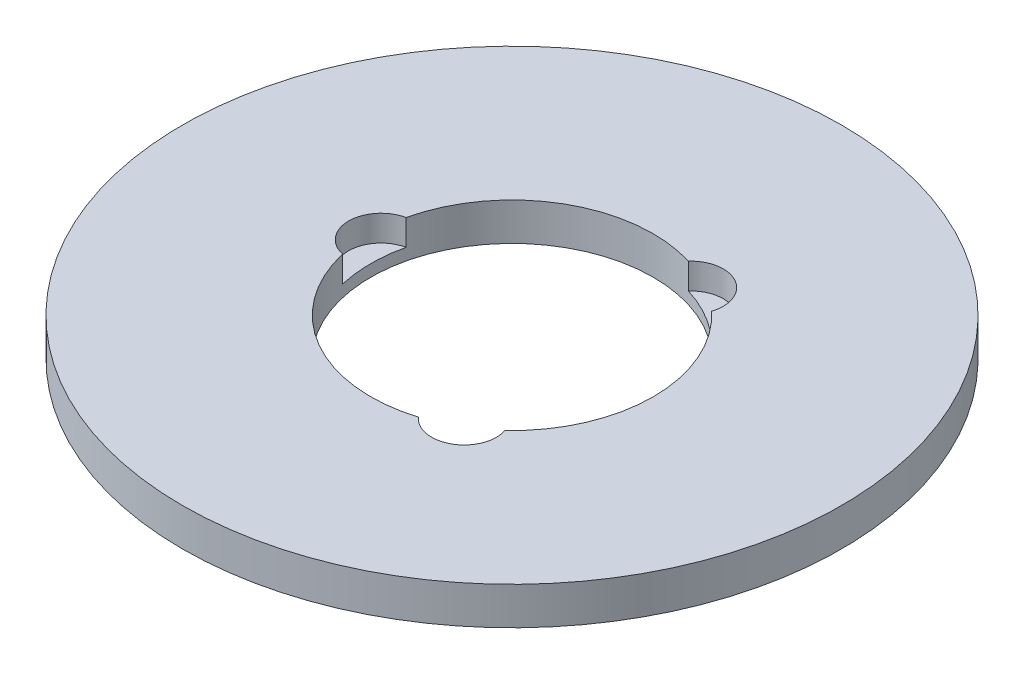
ISO-10303-21;
HEADER;
FILE_DESCRIPTION(('STEP AP214'),'2;1');
FILE_NAME('part.step','',(''),(''),'','','');
FILE_SCHEMA(('AUTOMOTIVE_DESIGN { 1 0 10303 214 1 1 1 1 }'));
ENDSEC;
DATA;
#1=APPLICATION_CONTEXT('core data for automotive mechanical design processes');
#2=APPLICATION_PROTOCOL_DEFINITION('international standard','automotive_design',2000,#1);
#3=PRODUCT_CONTEXT('',#1,'mechanical');
#4=PRODUCT('Part','Part','',(#3));
#5=PRODUCT_RELATED_PRODUCT_CATEGORY('part','',(#4));
#6=PRODUCT_DEFINITION_FORMATION('','',#4);
#7=PRODUCT_DEFINITION_CONTEXT('part definition',#1,'design');
#8=PRODUCT_DEFINITION('design','',#6,#7);
#9=PRODUCT_DEFINITION_SHAPE('','',#8);
#10=(LENGTH_UNIT() NAMED_UNIT(*) SI_UNIT(.MILLI.,.METRE.));
#11=(NAMED_UNIT(*) PLANE_ANGLE_UNIT() SI_UNIT($,.RADIAN.));
#12=(NAMED_UNIT(*) SI_UNIT($,.STERADIAN.) SOLID_ANGLE_UNIT());
#13=UNCERTAINTY_MEASURE_WITH_UNIT(LENGTH_MEASURE(1.E-05),#10,'distance_accuracy_value','');
#14=(GEOMETRIC_REPRESENTATION_CONTEXT(3) GLOBAL_UNCERTAINTY_ASSIGNED_CONTEXT((#13)) GLOBAL_UNIT_ASSIGNED_CONTEXT((#10,
#11,#12)) REPRESENTATION_CONTEXT('',''));
#15=CARTESIAN_POINT('',(0.,0.,0.));
#16=DIRECTION('',(0.,0.,1.));
#17=DIRECTION('',(1.,0.,0.));
#18=AXIS2_PLACEMENT_3D('',#15,#16,#17);
#19=CARTESIAN_POINT('',(0.,8.,0.));
#20=DIRECTION('',(0.,-1.,0.));
#21=DIRECTION('',(0.,0.,-1.));
#22=AXIS2_PLACEMENT_3D('',#19,#20,#21);
#23=CYLINDRICAL_SURFACE('',#22,70.);
#24=CARTESIAN_POINT('',(0.,8.,0.));
#25=DIRECTION('',(0.,1.,0.));
#26=DIRECTION('',(0.,0.,1.));
#27=AXIS2_PLACEMENT_3D('',#24,#25,#26);
#28=CIRCLE('',#27,70.);
#29=CARTESIAN_POINT('',(0.,8.,70.));
#30=VERTEX_POINT('',#29);
#31=EDGE_CURVE('E130',#30,#30,#28,.T.);
#32=ORIENTED_EDGE('',*,*,#31,.F.);
#33=EDGE_LOOP('',(#32));
#34=FACE_BOUND('',#33,.T.);
#35=CARTESIAN_POINT('',(0.,0.,0.));
#36=DIRECTION('',(0.,1.,0.));
#37=DIRECTION('',(0.,0.,1.));
#38=AXIS2_PLACEMENT_3D('',#35,#36,#37);
#39=CIRCLE('',#38,70.);
#40=CARTESIAN_POINT('',(0.,0.,70.));
#41=VERTEX_POINT('',#40);
#42=EDGE_CURVE('E117',#41,#41,#39,.T.);
#43=ORIENTED_EDGE('',*,*,#42,.T.);
#44=EDGE_LOOP('',(#43));
#45=FACE_BOUND('',#44,.T.);
#46=ADVANCED_FACE('F39',(#34,#45),#23,.T.);
#47=CARTESIAN_POINT('',(0.,8.,0.));
#48=DIRECTION('',(0.,1.,0.));
#49=DIRECTION('',(0.,0.,1.));
#50=AXIS2_PLACEMENT_3D('',#47,#48,#49);
#51=PLANE('',#50);
#52=CARTESIAN_POINT('',(13.9045154631195,8.,24.0833272367497));
#53=DIRECTION('',(0.,1.,0.));
#54=DIRECTION('',(0.866025403784436,0.,-0.500000000000004));
#55=AXIS2_PLACEMENT_3D('',#52,#53,#54);
#56=CIRCLE('',#55,6.88852052470689);
#57=CARTESIAN_POINT('',(8.77981268232638,8.,28.6864931503183));
#58=VERTEX_POINT('',#57);
#59=CARTESIAN_POINT('',(20.453325472501,8.,21.9467873985224));
#60=VERTEX_POINT('',#59);
#61=EDGE_CURVE('E148',#58,#60,#56,.T.);
#62=ORIENTED_EDGE('',*,*,#61,.F.);
#63=CARTESIAN_POINT('',(0.,8.,0.));
#64=DIRECTION('',(0.,1.,0.));
#65=DIRECTION('',(0.,0.,1.));
#66=AXIS2_PLACEMENT_3D('',#63,#64,#65);
#67=CIRCLE('',#66,30.);
#68=CARTESIAN_POINT('',(-29.2331381548271,8.,6.73970575179587));
#69=VERTEX_POINT('',#68);
#70=EDGE_CURVE('E113',#69,#58,#67,.T.);
#71=ORIENTED_EDGE('',*,*,#70,.F.);
#72=CARTESIAN_POINT('',(-27.8090309262387,8.,0.));
#73=DIRECTION('',(0.,1.,0.));
#74=DIRECTION('',(0.,0.,1.));
#75=AXIS2_PLACEMENT_3D('',#72,#73,#74);
#76=CIRCLE('',#75,6.88852052470689);
#77=CARTESIAN_POINT('',(-29.2331381548271,8.,-6.73970575179587));
#78=VERTEX_POINT('',#77);
#79=EDGE_CURVE('E125',#78,#69,#76,.T.);
#80=ORIENTED_EDGE('',*,*,#79,.F.);
#81=CARTESIAN_POINT('',(8.77981268232598,8.,-28.6864931503185));
#82=VERTEX_POINT('',#81);
#83=EDGE_CURVE('E107',#82,#78,#67,.T.);
#84=ORIENTED_EDGE('',*,*,#83,.F.);
#85=CARTESIAN_POINT('',(13.9045154631191,8.,-24.0833272367499));
#86=DIRECTION('',(0.,1.,0.));
#87=DIRECTION('',(-0.866025403784443,0.,-0.499999999999992));
#88=AXIS2_PLACEMENT_3D('',#85,#86,#87);
#89=CIRCLE('',#88,6.88852052470689);
#90=CARTESIAN_POINT('',(20.4533254725007,8.,-21.9467873985227));
#91=VERTEX_POINT('',#90);
#92=EDGE_CURVE('E95',#91,#82,#89,.T.);
#93=ORIENTED_EDGE('',*,*,#92,.F.);
#94=EDGE_CURVE('E106',#60,#91,#67,.T.);
#95=ORIENTED_EDGE('',*,*,#94,.F.);
#96=EDGE_LOOP('',(#62,#71,#80,#84,#93,#95));
#97=FACE_BOUND('',#96,.T.);
#98=ORIENTED_EDGE('',*,*,#31,.T.);
#99=EDGE_LOOP('',(#98));
#100=FACE_BOUND('',#99,.T.);
#101=ADVANCED_FACE('F102',(#97,#100),#51,.T.);
#102=CARTESIAN_POINT('',(0.,0.,0.));
#103=DIRECTION('',(0.,1.,0.));
#104=DIRECTION('',(0.,0.,1.));
#105=AXIS2_PLACEMENT_3D('',#102,#103,#104);
#106=PLANE('',#105);
#107=CARTESIAN_POINT('',(0.,0.,0.));
#108=DIRECTION('',(0.,1.,0.));
#109=DIRECTION('',(0.,0.,1.));
#110=AXIS2_PLACEMENT_3D('',#107,#108,#109);
#111=CIRCLE('',#110,30.);
#112=CARTESIAN_POINT('',(0.,0.,30.));
#113=VERTEX_POINT('',#112);
#114=EDGE_CURVE('E118',#113,#113,#111,.T.);
#115=ORIENTED_EDGE('',*,*,#114,.T.);
#116=EDGE_LOOP('',(#115));
#117=FACE_BOUND('',#116,.T.);
#118=ORIENTED_EDGE('',*,*,#42,.F.);
#119=EDGE_LOOP('',(#118));
#120=FACE_BOUND('',#119,.T.);
#121=ADVANCED_FACE('F161',(#117,#120),#106,.F.);
#122=CARTESIAN_POINT('',(0.,8.,0.));
#123=DIRECTION('',(0.,-1.,0.));
#124=DIRECTION('',(0.,0.,-1.));
#125=AXIS2_PLACEMENT_3D('',#122,#123,#124);
#126=CYLINDRICAL_SURFACE('',#125,30.);
#127=DIRECTION('',(0.,1.,0.));
#128=VECTOR('',#127,1.);
#129=CARTESIAN_POINT('',(8.77981268232637,5.25498888190115,28.6864931503183));
#130=LINE('',#129,#128);
#131=CARTESIAN_POINT('',(8.77981268232638,2.5099777638023,28.6864931503183));
#132=VERTEX_POINT('',#131);
#133=EDGE_CURVE('E11',#132,#58,#130,.T.);
#134=ORIENTED_EDGE('',*,*,#133,.F.);
#135=CARTESIAN_POINT('',(0.,2.5099777638023,0.));
#136=DIRECTION('',(0.,1.,0.));
#137=DIRECTION('',(0.,0.,1.));
#138=AXIS2_PLACEMENT_3D('',#135,#136,#137);
#139=CIRCLE('',#138,30.);
#140=CARTESIAN_POINT('',(20.453325472501,2.5099777638023,21.9467873985224));
#141=VERTEX_POINT('',#140);
#142=EDGE_CURVE('E100',#132,#141,#139,.T.);
#143=ORIENTED_EDGE('',*,*,#142,.T.);
#144=DIRECTION('',(0.,1.,0.));
#145=VECTOR('',#144,1.);
#146=CARTESIAN_POINT('',(20.453325472501,5.25498888190115,21.9467873985224));
#147=LINE('',#146,#145);
#148=EDGE_CURVE('E46',#60,#141,#147,.F.);
#149=ORIENTED_EDGE('',*,*,#148,.F.);
#150=ORIENTED_EDGE('',*,*,#94,.T.);
#151=DIRECTION('',(0.,1.,0.));
#152=VECTOR('',#151,1.);
#153=CARTESIAN_POINT('',(20.4533254725007,5.25498888190115,-21.9467873985227));
#154=LINE('',#153,#152);
#155=CARTESIAN_POINT('',(20.4533254725007,2.5099777638023,-21.9467873985227));
#156=VERTEX_POINT('',#155);
#157=EDGE_CURVE('E90',#156,#91,#154,.T.);
#158=ORIENTED_EDGE('',*,*,#157,.F.);
#159=CARTESIAN_POINT('',(0.,2.5099777638023,0.));
#160=DIRECTION('',(0.,1.,0.));
#161=DIRECTION('',(0.,0.,1.));
#162=AXIS2_PLACEMENT_3D('',#159,#160,#161);
#163=CIRCLE('',#162,30.);
#164=CARTESIAN_POINT('',(8.77981268232598,2.5099777638023,-28.6864931503185));
#165=VERTEX_POINT('',#164);
#166=EDGE_CURVE('E143',#156,#165,#163,.T.);
#167=ORIENTED_EDGE('',*,*,#166,.T.);
#168=DIRECTION('',(0.,1.,0.));
#169=VECTOR('',#168,1.);
#170=CARTESIAN_POINT('',(8.77981268232598,5.25498888190115,-28.6864931503185));
#171=LINE('',#170,#169);
#172=EDGE_CURVE('E98',#82,#165,#171,.F.);
#173=ORIENTED_EDGE('',*,*,#172,.F.);
#174=ORIENTED_EDGE('',*,*,#83,.T.);
#175=DIRECTION('',(0.,1.,0.));
#176=VECTOR('',#175,1.);
#177=CARTESIAN_POINT('',(-29.2331381548271,5.25498888190115,-6.73970575179587));
#178=LINE('',#177,#176);
#179=CARTESIAN_POINT('',(-29.2331381548271,2.5099777638023,-6.73970575179587));
#180=VERTEX_POINT('',#179);
#181=EDGE_CURVE('E137',#180,#78,#178,.T.);
#182=ORIENTED_EDGE('',*,*,#181,.F.);
#183=CARTESIAN_POINT('',(0.,2.5099777638023,0.));
#184=DIRECTION('',(0.,1.,0.));
#185=DIRECTION('',(0.,0.,1.));
#186=AXIS2_PLACEMENT_3D('',#183,#184,#185);
#187=CIRCLE('',#186,30.);
#188=CARTESIAN_POINT('',(-29.2331381548271,2.5099777638023,6.73970575179587));
#189=VERTEX_POINT('',#188);
#190=EDGE_CURVE('E128',#180,#189,#187,.T.);
#191=ORIENTED_EDGE('',*,*,#190,.T.);
#192=DIRECTION('',(0.,1.,0.));
#193=VECTOR('',#192,1.);
#194=CARTESIAN_POINT('',(-29.2331381548271,5.25498888190115,6.73970575179587));
#195=LINE('',#194,#193);
#196=EDGE_CURVE('E134',#69,#189,#195,.F.);
#197=ORIENTED_EDGE('',*,*,#196,.F.);
#198=ORIENTED_EDGE('',*,*,#70,.T.);
#199=EDGE_LOOP('',(#134,#143,#149,#150,#158,#167,#173,#174,#182,#191,#197,#198));
#200=FACE_BOUND('',#199,.T.);
#201=ORIENTED_EDGE('',*,*,#114,.F.);
#202=EDGE_LOOP('',(#201));
#203=FACE_BOUND('',#202,.T.);
#204=ADVANCED_FACE('F115',(#200,#203),#126,.F.);
#205=CARTESIAN_POINT('',(-27.8090309262387,2.5099777638023,0.));
#206=DIRECTION('',(0.,1.,0.));
#207=DIRECTION('',(0.,0.,1.));
#208=AXIS2_PLACEMENT_3D('',#205,#206,#207);
#209=CYLINDRICAL_SURFACE('',#208,6.88852052470689);
#210=ORIENTED_EDGE('',*,*,#181,.T.);
#211=ORIENTED_EDGE('',*,*,#79,.T.);
#212=ORIENTED_EDGE('',*,*,#196,.T.);
#213=CARTESIAN_POINT('',(-27.8090309262387,2.5099777638023,0.));
#214=DIRECTION('',(0.,1.,0.));
#215=DIRECTION('',(0.,0.,1.));
#216=AXIS2_PLACEMENT_3D('',#213,#214,#215);
#217=CIRCLE('',#216,6.88852052470689);
#218=EDGE_CURVE('E127',#180,#189,#217,.T.);
#219=ORIENTED_EDGE('',*,*,#218,.F.);
#220=EDGE_LOOP('',(#210,#211,#212,#219));
#221=FACE_BOUND('',#220,.T.);
#222=ADVANCED_FACE('F175',(#221),#209,.F.);
#223=CARTESIAN_POINT('',(-27.8090309262387,2.5099777638023,0.));
#224=DIRECTION('',(0.,1.,0.));
#225=DIRECTION('',(0.,0.,1.));
#226=AXIS2_PLACEMENT_3D('',#223,#224,#225);
#227=PLANE('',#226);
#228=ORIENTED_EDGE('',*,*,#218,.T.);
#229=ORIENTED_EDGE('',*,*,#190,.F.);
#230=EDGE_LOOP('',(#228,#229));
#231=FACE_BOUND('',#230,.T.);
#232=ADVANCED_FACE('F176',(#231),#227,.T.);
#233=CARTESIAN_POINT('',(13.9045154631191,2.5099777638023,-24.0833272367499));
#234=DIRECTION('',(0.,1.,0.));
#235=DIRECTION('',(0.,0.,1.));
#236=AXIS2_PLACEMENT_3D('',#233,#234,#235);
#237=CYLINDRICAL_SURFACE('',#236,6.88852052470689);
#238=ORIENTED_EDGE('',*,*,#157,.T.);
#239=ORIENTED_EDGE('',*,*,#92,.T.);
#240=ORIENTED_EDGE('',*,*,#172,.T.);
#241=CARTESIAN_POINT('',(13.9045154631191,2.5099777638023,-24.0833272367499));
#242=DIRECTION('',(0.,1.,0.));
#243=DIRECTION('',(-0.866025403784443,0.,-0.499999999999992));
#244=AXIS2_PLACEMENT_3D('',#241,#242,#243);
#245=CIRCLE('',#244,6.88852052470689);
#246=EDGE_CURVE('E56',#156,#165,#245,.T.);
#247=ORIENTED_EDGE('',*,*,#246,.F.);
#248=EDGE_LOOP('',(#238,#239,#240,#247));
#249=FACE_BOUND('',#248,.T.);
#250=ADVANCED_FACE('F93',(#249),#237,.F.);
#251=CARTESIAN_POINT('',(13.9045154631191,2.5099777638023,-24.0833272367499));
#252=DIRECTION('',(0.,1.,0.));
#253=DIRECTION('',(-0.866025403784443,0.,-0.499999999999992));
#254=AXIS2_PLACEMENT_3D('',#251,#252,#253);
#255=PLANE('',#254);
#256=ORIENTED_EDGE('',*,*,#246,.T.);
#257=ORIENTED_EDGE('',*,*,#166,.F.);
#258=EDGE_LOOP('',(#256,#257));
#259=FACE_BOUND('',#258,.T.);
#260=ADVANCED_FACE('F153',(#259),#255,.T.);
#261=CARTESIAN_POINT('',(13.9045154631195,2.5099777638023,24.0833272367497));
#262=DIRECTION('',(0.,1.,0.));
#263=DIRECTION('',(0.,0.,1.));
#264=AXIS2_PLACEMENT_3D('',#261,#262,#263);
#265=CYLINDRICAL_SURFACE('',#264,6.88852052470689);
#266=ORIENTED_EDGE('',*,*,#133,.T.);
#267=ORIENTED_EDGE('',*,*,#61,.T.);
#268=ORIENTED_EDGE('',*,*,#148,.T.);
#269=CARTESIAN_POINT('',(13.9045154631195,2.5099777638023,24.0833272367497));
#270=DIRECTION('',(0.,1.,0.));
#271=DIRECTION('',(0.866025403784436,0.,-0.500000000000004));
#272=AXIS2_PLACEMENT_3D('',#269,#270,#271);
#273=CIRCLE('',#272,6.88852052470689);
#274=EDGE_CURVE('E55',#132,#141,#273,.T.);
#275=ORIENTED_EDGE('',*,*,#274,.F.);
#276=EDGE_LOOP('',(#266,#267,#268,#275));
#277=FACE_BOUND('',#276,.T.);
#278=ADVANCED_FACE('F144',(#277),#265,.F.);
#279=CARTESIAN_POINT('',(13.9045154631195,2.5099777638023,24.0833272367497));
#280=DIRECTION('',(0.,1.,0.));
#281=DIRECTION('',(0.866025403784436,0.,-0.500000000000004));
#282=AXIS2_PLACEMENT_3D('',#279,#280,#281);
#283=PLANE('',#282);
#284=ORIENTED_EDGE('',*,*,#274,.T.);
#285=ORIENTED_EDGE('',*,*,#142,.F.);
#286=EDGE_LOOP('',(#284,#285));
#287=FACE_BOUND('',#286,.T.);
#288=ADVANCED_FACE('F150',(#287),#283,.T.);
#289=CLOSED_SHELL('',(#46,#101,#121,#204,#222,#232,#250,#260,#278,#288));
#290=MANIFOLD_SOLID_BREP('B2',#289);
#291=ADVANCED_BREP_SHAPE_REPRESENTATION('',(#18,#290),#14);
#292=SHAPE_DEFINITION_REPRESENTATION(#9,#291);
ENDSEC;
END-ISO-10303-21;
